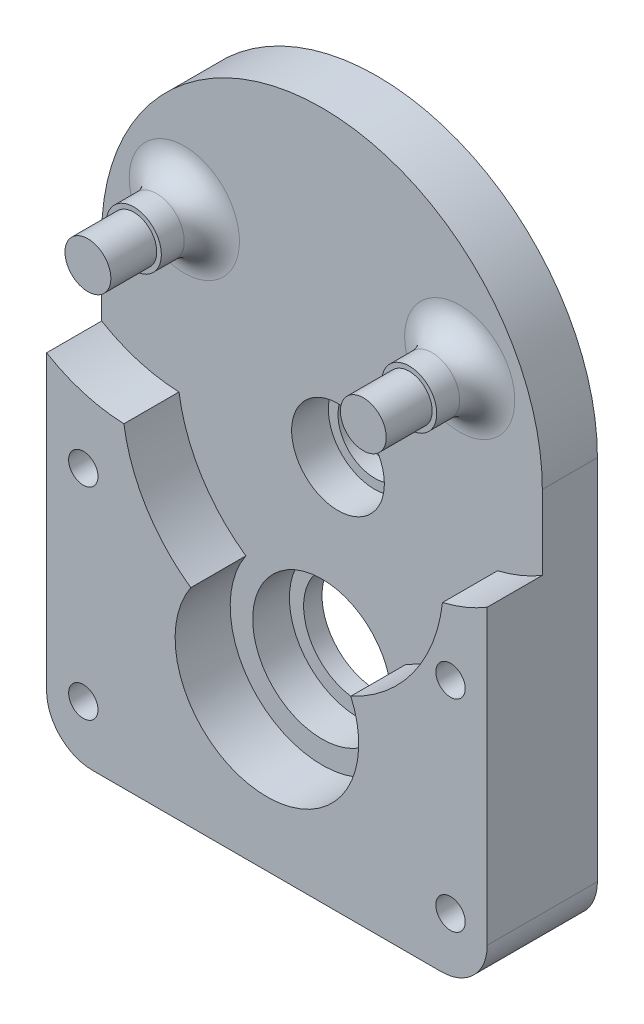
ISO-10303-21;
HEADER;
FILE_DESCRIPTION(('STEP AP214'),'2;1');
FILE_NAME('part.step','',(''),(''),'','','');
FILE_SCHEMA(('AUTOMOTIVE_DESIGN { 1 0 10303 214 1 1 1 1 }'));
ENDSEC;
DATA;
#1=APPLICATION_CONTEXT('core data for automotive mechanical design processes');
#2=APPLICATION_PROTOCOL_DEFINITION('international standard','automotive_design',2000,#1);
#3=PRODUCT_CONTEXT('',#1,'mechanical');
#4=PRODUCT('Part','Part','',(#3));
#5=PRODUCT_RELATED_PRODUCT_CATEGORY('part','',(#4));
#6=PRODUCT_DEFINITION_FORMATION('','',#4);
#7=PRODUCT_DEFINITION_CONTEXT('part definition',#1,'design');
#8=PRODUCT_DEFINITION('design','',#6,#7);
#9=PRODUCT_DEFINITION_SHAPE('','',#8);
#10=(LENGTH_UNIT() NAMED_UNIT(*) SI_UNIT(.MILLI.,.METRE.));
#11=(NAMED_UNIT(*) PLANE_ANGLE_UNIT() SI_UNIT($,.RADIAN.));
#12=(NAMED_UNIT(*) SI_UNIT($,.STERADIAN.) SOLID_ANGLE_UNIT());
#13=UNCERTAINTY_MEASURE_WITH_UNIT(LENGTH_MEASURE(1.E-05),#10,'distance_accuracy_value','');
#14=(GEOMETRIC_REPRESENTATION_CONTEXT(3) GLOBAL_UNCERTAINTY_ASSIGNED_CONTEXT((#13)) GLOBAL_UNIT_ASSIGNED_CONTEXT((#10,
#11,#12)) REPRESENTATION_CONTEXT('',''));
#15=CARTESIAN_POINT('',(0.,0.,0.));
#16=DIRECTION('',(0.,0.,1.));
#17=DIRECTION('',(1.,0.,0.));
#18=AXIS2_PLACEMENT_3D('',#15,#16,#17);
#19=CARTESIAN_POINT('',(20.,-39.,16.5));
#20=DIRECTION('',(0.,0.,-1.));
#21=DIRECTION('',(-1.,0.,0.));
#22=AXIS2_PLACEMENT_3D('',#19,#20,#21);
#23=CYLINDRICAL_SURFACE('',#22,1.6);
#24=CARTESIAN_POINT('',(20.,-39.,12.));
#25=DIRECTION('',(0.,0.,1.));
#26=DIRECTION('',(1.,0.,0.));
#27=AXIS2_PLACEMENT_3D('',#24,#25,#26);
#28=CIRCLE('',#27,1.6);
#29=CARTESIAN_POINT('',(21.6,-39.,12.));
#30=VERTEX_POINT('',#29);
#31=EDGE_CURVE('E239',#30,#30,#28,.T.);
#32=ORIENTED_EDGE('',*,*,#31,.T.);
#33=EDGE_LOOP('',(#32));
#34=FACE_BOUND('',#33,.T.);
#35=CARTESIAN_POINT('',(20.,-39.,6.));
#36=DIRECTION('',(0.,0.,-1.));
#37=DIRECTION('',(-1.,0.,0.));
#38=AXIS2_PLACEMENT_3D('',#35,#36,#37);
#39=CIRCLE('',#38,1.6);
#40=CARTESIAN_POINT('',(18.4,-39.,6.));
#41=VERTEX_POINT('',#40);
#42=EDGE_CURVE('E243',#41,#41,#39,.F.);
#43=ORIENTED_EDGE('',*,*,#42,.F.);
#44=EDGE_LOOP('',(#43));
#45=FACE_BOUND('',#44,.T.);
#46=ADVANCED_FACE('F41',(#34,#45),#23,.F.);
#47=CARTESIAN_POINT('',(-20.,-17.,16.5));
#48=DIRECTION('',(0.,0.,-1.));
#49=DIRECTION('',(-1.,0.,0.));
#50=AXIS2_PLACEMENT_3D('',#47,#48,#49);
#51=CYLINDRICAL_SURFACE('',#50,1.6);
#52=CARTESIAN_POINT('',(-20.,-17.,12.));
#53=DIRECTION('',(0.,0.,1.));
#54=DIRECTION('',(1.,0.,0.));
#55=AXIS2_PLACEMENT_3D('',#52,#53,#54);
#56=CIRCLE('',#55,1.6);
#57=CARTESIAN_POINT('',(-18.4,-17.,12.));
#58=VERTEX_POINT('',#57);
#59=EDGE_CURVE('E242',#58,#58,#56,.T.);
#60=ORIENTED_EDGE('',*,*,#59,.T.);
#61=EDGE_LOOP('',(#60));
#62=FACE_BOUND('',#61,.T.);
#63=CARTESIAN_POINT('',(-20.,-17.,6.));
#64=DIRECTION('',(0.,0.,-1.));
#65=DIRECTION('',(-1.,0.,0.));
#66=AXIS2_PLACEMENT_3D('',#63,#64,#65);
#67=CIRCLE('',#66,1.6);
#68=CARTESIAN_POINT('',(-21.6,-17.,6.));
#69=VERTEX_POINT('',#68);
#70=EDGE_CURVE('E259',#69,#69,#67,.F.);
#71=ORIENTED_EDGE('',*,*,#70,.F.);
#72=EDGE_LOOP('',(#71));
#73=FACE_BOUND('',#72,.T.);
#74=ADVANCED_FACE('F437',(#62,#73),#51,.F.);
#75=CARTESIAN_POINT('',(-20.,-39.,16.5));
#76=DIRECTION('',(0.,0.,-1.));
#77=DIRECTION('',(-1.,0.,0.));
#78=AXIS2_PLACEMENT_3D('',#75,#76,#77);
#79=CYLINDRICAL_SURFACE('',#78,1.6);
#80=CARTESIAN_POINT('',(-20.,-39.,12.));
#81=DIRECTION('',(0.,0.,1.));
#82=DIRECTION('',(1.,0.,0.));
#83=AXIS2_PLACEMENT_3D('',#80,#81,#82);
#84=CIRCLE('',#83,1.6);
#85=CARTESIAN_POINT('',(-18.4,-39.,12.));
#86=VERTEX_POINT('',#85);
#87=EDGE_CURVE('E246',#86,#86,#84,.T.);
#88=ORIENTED_EDGE('',*,*,#87,.T.);
#89=EDGE_LOOP('',(#88));
#90=FACE_BOUND('',#89,.T.);
#91=CARTESIAN_POINT('',(-20.,-39.,6.));
#92=DIRECTION('',(0.,0.,-1.));
#93=DIRECTION('',(-1.,0.,0.));
#94=AXIS2_PLACEMENT_3D('',#91,#92,#93);
#95=CIRCLE('',#94,1.6);
#96=CARTESIAN_POINT('',(-21.6,-39.,6.));
#97=VERTEX_POINT('',#96);
#98=EDGE_CURVE('E255',#97,#97,#95,.F.);
#99=ORIENTED_EDGE('',*,*,#98,.F.);
#100=EDGE_LOOP('',(#99));
#101=FACE_BOUND('',#100,.T.);
#102=ADVANCED_FACE('F443',(#90,#101),#79,.F.);
#103=CARTESIAN_POINT('',(20.,-17.,16.5));
#104=DIRECTION('',(0.,0.,-1.));
#105=DIRECTION('',(-1.,0.,0.));
#106=AXIS2_PLACEMENT_3D('',#103,#104,#105);
#107=CYLINDRICAL_SURFACE('',#106,1.6);
#108=CARTESIAN_POINT('',(20.,-17.,12.));
#109=DIRECTION('',(0.,0.,1.));
#110=DIRECTION('',(1.,0.,0.));
#111=AXIS2_PLACEMENT_3D('',#108,#109,#110);
#112=CIRCLE('',#111,1.6);
#113=CARTESIAN_POINT('',(21.6,-17.,12.));
#114=VERTEX_POINT('',#113);
#115=EDGE_CURVE('E249',#114,#114,#112,.T.);
#116=ORIENTED_EDGE('',*,*,#115,.T.);
#117=EDGE_LOOP('',(#116));
#118=FACE_BOUND('',#117,.T.);
#119=CARTESIAN_POINT('',(20.,-17.,6.));
#120=DIRECTION('',(0.,0.,-1.));
#121=DIRECTION('',(-1.,0.,0.));
#122=AXIS2_PLACEMENT_3D('',#119,#120,#121);
#123=CIRCLE('',#122,1.6);
#124=CARTESIAN_POINT('',(18.4,-17.,6.));
#125=VERTEX_POINT('',#124);
#126=EDGE_CURVE('E252',#125,#125,#123,.F.);
#127=ORIENTED_EDGE('',*,*,#126,.F.);
#128=EDGE_LOOP('',(#127));
#129=FACE_BOUND('',#128,.T.);
#130=ADVANCED_FACE('F400',(#118,#129),#107,.F.);
#131=CARTESIAN_POINT('',(0.,0.,6.));
#132=DIRECTION('',(0.,0.,-1.));
#133=DIRECTION('',(-1.,0.,0.));
#134=AXIS2_PLACEMENT_3D('',#131,#132,#133);
#135=PLANE('',#134);
#136=CARTESIAN_POINT('',(1.74311485495303,-8.07610603816508,6.));
#137=DIRECTION('',(0.,0.,1.));
#138=DIRECTION('',(1.,0.,0.));
#139=AXIS2_PLACEMENT_3D('',#136,#137,#138);
#140=CIRCLE('',#139,5.05);
#141=CARTESIAN_POINT('',(6.79311485495303,-8.07610603816508,6.));
#142=VERTEX_POINT('',#141);
#143=EDGE_CURVE('E178',#142,#142,#140,.T.);
#144=ORIENTED_EDGE('',*,*,#143,.F.);
#145=EDGE_LOOP('',(#144));
#146=FACE_BOUND('',#145,.T.);
#147=CARTESIAN_POINT('',(0.,-28.,6.));
#148=DIRECTION('',(0.,0.,1.));
#149=DIRECTION('',(1.,0.,0.));
#150=AXIS2_PLACEMENT_3D('',#147,#148,#149);
#151=CIRCLE('',#150,7.55);
#152=CARTESIAN_POINT('',(7.55,-28.,6.));
#153=VERTEX_POINT('',#152);
#154=EDGE_CURVE('E167',#153,#153,#151,.T.);
#155=ORIENTED_EDGE('',*,*,#154,.F.);
#156=EDGE_LOOP('',(#155));
#157=FACE_BOUND('',#156,.T.);
#158=CARTESIAN_POINT('',(-15.,6.89903991274414,6.));
#159=DIRECTION('',(0.,0.,-1.));
#160=DIRECTION('',(-1.,0.,0.));
#161=AXIS2_PLACEMENT_3D('',#158,#159,#160);
#162=CIRCLE('',#161,6.);
#163=CARTESIAN_POINT('',(-21.,6.89903991274414,6.));
#164=VERTEX_POINT('',#163);
#165=EDGE_CURVE('E229',#164,#164,#162,.T.);
#166=ORIENTED_EDGE('',*,*,#165,.T.);
#167=EDGE_LOOP('',(#166));
#168=FACE_BOUND('',#167,.T.);
#169=CARTESIAN_POINT('',(15.,6.89903991274414,6.));
#170=DIRECTION('',(0.,0.,-1.));
#171=DIRECTION('',(-1.,0.,0.));
#172=AXIS2_PLACEMENT_3D('',#169,#170,#171);
#173=CIRCLE('',#172,6.);
#174=CARTESIAN_POINT('',(9.,6.89903991274414,6.));
#175=VERTEX_POINT('',#174);
#176=EDGE_CURVE('E232',#175,#175,#173,.T.);
#177=ORIENTED_EDGE('',*,*,#176,.T.);
#178=EDGE_LOOP('',(#177));
#179=FACE_BOUND('',#178,.T.);
#180=CARTESIAN_POINT('',(-15.,6.89903991274414,6.));
#181=DIRECTION('',(0.,0.,-1.));
#182=DIRECTION('',(1.,0.,0.));
#183=AXIS2_PLACEMENT_3D('',#180,#181,#182);
#184=CIRCLE('',#183,17.5);
#185=CARTESIAN_POINT('',(-15.5751634768211,-10.5915057326876,6.));
#186=VERTEX_POINT('',#185);
#187=CARTESIAN_POINT('',(-24.,-8.10929110705949,6.));
#188=VERTEX_POINT('',#187);
#189=EDGE_CURVE('E322',#186,#188,#184,.T.);
#190=ORIENTED_EDGE('',*,*,#189,.F.);
#191=CARTESIAN_POINT('',(1.74311485495303,-8.07610603816508,6.));
#192=DIRECTION('',(0.,0.,-1.));
#193=DIRECTION('',(1.,0.,0.));
#194=AXIS2_PLACEMENT_3D('',#191,#192,#193);
#195=CIRCLE('',#194,17.5);
#196=CARTESIAN_POINT('',(-8.29315308800893,-22.4121907818137,6.));
#197=VERTEX_POINT('',#196);
#198=EDGE_CURVE('E327',#197,#186,#195,.T.);
#199=ORIENTED_EDGE('',*,*,#198,.F.);
#200=CARTESIAN_POINT('',(0.,-28.,6.));
#201=DIRECTION('',(0.,0.,-1.));
#202=DIRECTION('',(1.,0.,0.));
#203=AXIS2_PLACEMENT_3D('',#200,#201,#202);
#204=CIRCLE('',#203,10.);
#205=CARTESIAN_POINT('',(9.1374743458768,-23.9371730804225,6.));
#206=VERTEX_POINT('',#205);
#207=EDGE_CURVE('E328',#206,#197,#204,.T.);
#208=ORIENTED_EDGE('',*,*,#207,.F.);
#209=CARTESIAN_POINT('',(1.74311485495303,-8.07610603816508,6.));
#210=DIRECTION('',(0.,0.,-1.));
#211=DIRECTION('',(1.,0.,0.));
#212=AXIS2_PLACEMENT_3D('',#209,#210,#211);
#213=CIRCLE('',#212,17.5);
#214=CARTESIAN_POINT('',(19.1247654344826,-10.1079089644207,6.));
#215=VERTEX_POINT('',#214);
#216=EDGE_CURVE('E156',#215,#206,#213,.T.);
#217=ORIENTED_EDGE('',*,*,#216,.F.);
#218=CARTESIAN_POINT('',(15.,6.89903991274414,6.));
#219=DIRECTION('',(0.,0.,-1.));
#220=DIRECTION('',(1.,0.,0.));
#221=AXIS2_PLACEMENT_3D('',#218,#219,#220);
#222=CIRCLE('',#221,17.5);
#223=CARTESIAN_POINT('',(24.,-8.10929110705949,6.));
#224=VERTEX_POINT('',#223);
#225=EDGE_CURVE('E153',#224,#215,#222,.T.);
#226=ORIENTED_EDGE('',*,*,#225,.F.);
#227=DIRECTION('',(0.,1.,0.));
#228=VECTOR('',#227,1.);
#229=CARTESIAN_POINT('',(24.,-45.,6.));
#230=LINE('',#229,#228);
#231=CARTESIAN_POINT('',(24.,0.,6.));
#232=VERTEX_POINT('',#231);
#233=EDGE_CURVE('E213',#224,#232,#230,.T.);
#234=ORIENTED_EDGE('',*,*,#233,.T.);
#235=CARTESIAN_POINT('',(0.,0.,6.));
#236=DIRECTION('',(0.,0.,1.));
#237=DIRECTION('',(-1.,0.,0.));
#238=AXIS2_PLACEMENT_3D('',#235,#236,#237);
#239=CIRCLE('',#238,24.);
#240=CARTESIAN_POINT('',(-24.,0.,6.));
#241=VERTEX_POINT('',#240);
#242=EDGE_CURVE('E207',#232,#241,#239,.T.);
#243=ORIENTED_EDGE('',*,*,#242,.T.);
#244=DIRECTION('',(0.,-1.,0.));
#245=VECTOR('',#244,1.);
#246=CARTESIAN_POINT('',(-24.,0.,6.));
#247=LINE('',#246,#245);
#248=EDGE_CURVE('E210',#241,#188,#247,.T.);
#249=ORIENTED_EDGE('',*,*,#248,.T.);
#250=EDGE_LOOP('',(#190,#199,#208,#217,#226,#234,#243,#249));
#251=FACE_BOUND('',#250,.T.);
#252=ADVANCED_FACE('F397',(#146,#157,#168,#179,#251),#135,.F.);
#253=CARTESIAN_POINT('',(0.,0.,6.));
#254=DIRECTION('',(0.,0.,-1.));
#255=DIRECTION('',(-1.,0.,0.));
#256=AXIS2_PLACEMENT_3D('',#253,#254,#255);
#257=CYLINDRICAL_SURFACE('',#256,24.);
#258=CARTESIAN_POINT('',(0.,0.,0.));
#259=DIRECTION('',(0.,0.,1.));
#260=DIRECTION('',(-1.,0.,0.));
#261=AXIS2_PLACEMENT_3D('',#258,#259,#260);
#262=CIRCLE('',#261,24.);
#263=CARTESIAN_POINT('',(24.,0.,0.));
#264=VERTEX_POINT('',#263);
#265=CARTESIAN_POINT('',(-24.,0.,0.));
#266=VERTEX_POINT('',#265);
#267=EDGE_CURVE('E206',#264,#266,#262,.T.);
#268=ORIENTED_EDGE('',*,*,#267,.T.);
#269=DIRECTION('',(0.,0.,-1.));
#270=VECTOR('',#269,1.);
#271=CARTESIAN_POINT('',(-24.,0.,6.));
#272=LINE('',#271,#270);
#273=EDGE_CURVE('E200',#241,#266,#272,.T.);
#274=ORIENTED_EDGE('',*,*,#273,.F.);
#275=ORIENTED_EDGE('',*,*,#242,.F.);
#276=DIRECTION('',(0.,0.,-1.));
#277=VECTOR('',#276,1.);
#278=CARTESIAN_POINT('',(24.,0.,6.));
#279=LINE('',#278,#277);
#280=EDGE_CURVE('E215',#232,#264,#279,.T.);
#281=ORIENTED_EDGE('',*,*,#280,.T.);
#282=EDGE_LOOP('',(#268,#274,#275,#281));
#283=FACE_BOUND('',#282,.T.);
#284=ADVANCED_FACE('F303',(#283),#257,.T.);
#285=CARTESIAN_POINT('',(-24.,0.,6.));
#286=DIRECTION('',(1.,0.,0.));
#287=DIRECTION('',(0.,1.,0.));
#288=AXIS2_PLACEMENT_3D('',#285,#286,#287);
#289=PLANE('',#288);
#290=DIRECTION('',(0.,-1.,0.));
#291=VECTOR('',#290,1.);
#292=CARTESIAN_POINT('',(-24.,0.,0.));
#293=LINE('',#292,#291);
#294=CARTESIAN_POINT('',(-24.,-40.,0.));
#295=VERTEX_POINT('',#294);
#296=EDGE_CURVE('E218',#266,#295,#293,.T.);
#297=ORIENTED_EDGE('',*,*,#296,.T.);
#298=DIRECTION('',(0.,0.,-1.));
#299=VECTOR('',#298,1.);
#300=CARTESIAN_POINT('',(-24.,-40.,6.));
#301=LINE('',#300,#299);
#302=CARTESIAN_POINT('',(-24.,-40.,12.));
#303=VERTEX_POINT('',#302);
#304=EDGE_CURVE('E11',#295,#303,#301,.F.);
#305=ORIENTED_EDGE('',*,*,#304,.T.);
#306=DIRECTION('',(0.,-1.,0.));
#307=VECTOR('',#306,1.);
#308=CARTESIAN_POINT('',(-24.,-8.10929110705949,12.));
#309=LINE('',#308,#307);
#310=CARTESIAN_POINT('',(-24.,-8.10929110705949,12.));
#311=VERTEX_POINT('',#310);
#312=EDGE_CURVE('E336',#311,#303,#309,.T.);
#313=ORIENTED_EDGE('',*,*,#312,.F.);
#314=DIRECTION('',(0.,0.,-1.));
#315=VECTOR('',#314,1.);
#316=CARTESIAN_POINT('',(-24.,-8.10929110705949,12.));
#317=LINE('',#316,#315);
#318=EDGE_CURVE('E309',#311,#188,#317,.T.);
#319=ORIENTED_EDGE('',*,*,#318,.T.);
#320=ORIENTED_EDGE('',*,*,#248,.F.);
#321=ORIENTED_EDGE('',*,*,#273,.T.);
#322=EDGE_LOOP('',(#297,#305,#313,#319,#320,#321));
#323=FACE_BOUND('',#322,.T.);
#324=ADVANCED_FACE('F298',(#323),#289,.F.);
#325=CARTESIAN_POINT('',(-24.,-45.,6.));
#326=DIRECTION('',(0.,1.,0.));
#327=DIRECTION('',(0.,0.,1.));
#328=AXIS2_PLACEMENT_3D('',#325,#326,#327);
#329=PLANE('',#328);
#330=DIRECTION('',(1.,0.,0.));
#331=VECTOR('',#330,1.);
#332=CARTESIAN_POINT('',(-24.,-45.,0.));
#333=LINE('',#332,#331);
#334=CARTESIAN_POINT('',(-19.,-45.,0.));
#335=VERTEX_POINT('',#334);
#336=CARTESIAN_POINT('',(19.,-45.,0.));
#337=VERTEX_POINT('',#336);
#338=EDGE_CURVE('E220',#335,#337,#333,.T.);
#339=ORIENTED_EDGE('',*,*,#338,.T.);
#340=DIRECTION('',(0.,0.,-1.));
#341=VECTOR('',#340,1.);
#342=CARTESIAN_POINT('',(19.,-45.,6.));
#343=LINE('',#342,#341);
#344=CARTESIAN_POINT('',(19.,-45.,12.));
#345=VERTEX_POINT('',#344);
#346=EDGE_CURVE('E62',#337,#345,#343,.F.);
#347=ORIENTED_EDGE('',*,*,#346,.T.);
#348=DIRECTION('',(1.,0.,0.));
#349=VECTOR('',#348,1.);
#350=CARTESIAN_POINT('',(-24.,-45.,12.));
#351=LINE('',#350,#349);
#352=CARTESIAN_POINT('',(-19.,-45.,12.));
#353=VERTEX_POINT('',#352);
#354=EDGE_CURVE('E279',#353,#345,#351,.T.);
#355=ORIENTED_EDGE('',*,*,#354,.F.);
#356=DIRECTION('',(0.,0.,-1.));
#357=VECTOR('',#356,1.);
#358=CARTESIAN_POINT('',(-19.,-45.,6.));
#359=LINE('',#358,#357);
#360=EDGE_CURVE('E270',#353,#335,#359,.T.);
#361=ORIENTED_EDGE('',*,*,#360,.T.);
#362=EDGE_LOOP('',(#339,#347,#355,#361));
#363=FACE_BOUND('',#362,.T.);
#364=ADVANCED_FACE('F294',(#363),#329,.F.);
#365=CARTESIAN_POINT('',(24.,-45.,6.));
#366=DIRECTION('',(-1.,0.,0.));
#367=DIRECTION('',(0.,0.,1.));
#368=AXIS2_PLACEMENT_3D('',#365,#366,#367);
#369=PLANE('',#368);
#370=DIRECTION('',(0.,1.,0.));
#371=VECTOR('',#370,1.);
#372=CARTESIAN_POINT('',(24.,-45.,12.));
#373=LINE('',#372,#371);
#374=CARTESIAN_POINT('',(24.,-40.,12.));
#375=VERTEX_POINT('',#374);
#376=CARTESIAN_POINT('',(24.,-8.10929110705949,12.));
#377=VERTEX_POINT('',#376);
#378=EDGE_CURVE('E277',#375,#377,#373,.T.);
#379=ORIENTED_EDGE('',*,*,#378,.F.);
#380=DIRECTION('',(0.,0.,-1.));
#381=VECTOR('',#380,1.);
#382=CARTESIAN_POINT('',(24.,-40.,6.));
#383=LINE('',#382,#381);
#384=CARTESIAN_POINT('',(24.,-40.,0.));
#385=VERTEX_POINT('',#384);
#386=EDGE_CURVE('E238',#375,#385,#383,.T.);
#387=ORIENTED_EDGE('',*,*,#386,.T.);
#388=DIRECTION('',(0.,1.,0.));
#389=VECTOR('',#388,1.);
#390=CARTESIAN_POINT('',(24.,-45.,0.));
#391=LINE('',#390,#389);
#392=EDGE_CURVE('E211',#385,#264,#391,.T.);
#393=ORIENTED_EDGE('',*,*,#392,.T.);
#394=ORIENTED_EDGE('',*,*,#280,.F.);
#395=ORIENTED_EDGE('',*,*,#233,.F.);
#396=DIRECTION('',(0.,0.,-1.));
#397=VECTOR('',#396,1.);
#398=CARTESIAN_POINT('',(24.,-8.10929110705949,12.));
#399=LINE('',#398,#397);
#400=EDGE_CURVE('E287',#377,#224,#399,.T.);
#401=ORIENTED_EDGE('',*,*,#400,.F.);
#402=EDGE_LOOP('',(#379,#387,#393,#394,#395,#401));
#403=FACE_BOUND('',#402,.T.);
#404=ADVANCED_FACE('F283',(#403),#369,.F.);
#405=CARTESIAN_POINT('',(0.,0.,0.));
#406=DIRECTION('',(0.,0.,-1.));
#407=DIRECTION('',(-1.,0.,0.));
#408=AXIS2_PLACEMENT_3D('',#405,#406,#407);
#409=PLANE('',#408);
#410=CARTESIAN_POINT('',(20.,-39.,0.));
#411=DIRECTION('',(0.,0.,-1.));
#412=DIRECTION('',(-1.,0.,0.));
#413=AXIS2_PLACEMENT_3D('',#410,#411,#412);
#414=CIRCLE('',#413,2.1);
#415=CARTESIAN_POINT('',(17.9,-39.,0.));
#416=VERTEX_POINT('',#415);
#417=EDGE_CURVE('E343',#416,#416,#414,.T.);
#418=ORIENTED_EDGE('',*,*,#417,.F.);
#419=EDGE_LOOP('',(#418));
#420=FACE_BOUND('',#419,.T.);
#421=CARTESIAN_POINT('',(-20.,-17.,0.));
#422=DIRECTION('',(0.,0.,-1.));
#423=DIRECTION('',(-1.,0.,0.));
#424=AXIS2_PLACEMENT_3D('',#421,#422,#423);
#425=CIRCLE('',#424,2.1);
#426=CARTESIAN_POINT('',(-22.1,-17.,0.));
#427=VERTEX_POINT('',#426);
#428=EDGE_CURVE('E349',#427,#427,#425,.T.);
#429=ORIENTED_EDGE('',*,*,#428,.F.);
#430=EDGE_LOOP('',(#429));
#431=FACE_BOUND('',#430,.T.);
#432=CARTESIAN_POINT('',(-20.,-39.,0.));
#433=DIRECTION('',(0.,0.,-1.));
#434=DIRECTION('',(-1.,0.,0.));
#435=AXIS2_PLACEMENT_3D('',#432,#433,#434);
#436=CIRCLE('',#435,2.1);
#437=CARTESIAN_POINT('',(-22.1,-39.,0.));
#438=VERTEX_POINT('',#437);
#439=EDGE_CURVE('E350',#438,#438,#436,.T.);
#440=ORIENTED_EDGE('',*,*,#439,.F.);
#441=EDGE_LOOP('',(#440));
#442=FACE_BOUND('',#441,.T.);
#443=CARTESIAN_POINT('',(20.,-17.,0.));
#444=DIRECTION('',(0.,0.,-1.));
#445=DIRECTION('',(-1.,0.,0.));
#446=AXIS2_PLACEMENT_3D('',#443,#444,#445);
#447=CIRCLE('',#446,2.1);
#448=CARTESIAN_POINT('',(17.9,-17.,0.));
#449=VERTEX_POINT('',#448);
#450=EDGE_CURVE('E340',#449,#449,#447,.T.);
#451=ORIENTED_EDGE('',*,*,#450,.F.);
#452=EDGE_LOOP('',(#451));
#453=FACE_BOUND('',#452,.T.);
#454=CARTESIAN_POINT('',(0.,-28.,0.));
#455=DIRECTION('',(0.,0.,1.));
#456=DIRECTION('',(1.,0.,0.));
#457=AXIS2_PLACEMENT_3D('',#454,#455,#456);
#458=CIRCLE('',#457,6.);
#459=CARTESIAN_POINT('',(6.,-28.,0.));
#460=VERTEX_POINT('',#459);
#461=EDGE_CURVE('E160',#460,#460,#458,.T.);
#462=ORIENTED_EDGE('',*,*,#461,.T.);
#463=EDGE_LOOP('',(#462));
#464=FACE_BOUND('',#463,.T.);
#465=CARTESIAN_POINT('',(1.74311485495303,-8.07610603816508,0.));
#466=DIRECTION('',(0.,0.,1.));
#467=DIRECTION('',(1.,0.,0.));
#468=AXIS2_PLACEMENT_3D('',#465,#466,#467);
#469=CIRCLE('',#468,4.);
#470=CARTESIAN_POINT('',(5.74311485495303,-8.07610603816508,0.));
#471=VERTEX_POINT('',#470);
#472=EDGE_CURVE('E175',#471,#471,#469,.T.);
#473=ORIENTED_EDGE('',*,*,#472,.T.);
#474=EDGE_LOOP('',(#473));
#475=FACE_BOUND('',#474,.T.);
#476=ORIENTED_EDGE('',*,*,#392,.F.);
#477=CARTESIAN_POINT('',(19.,-40.,0.));
#478=DIRECTION('',(0.,0.,-1.));
#479=DIRECTION('',(-1.,0.,0.));
#480=AXIS2_PLACEMENT_3D('',#477,#478,#479);
#481=CIRCLE('',#480,5.);
#482=EDGE_CURVE('E268',#385,#337,#481,.T.);
#483=ORIENTED_EDGE('',*,*,#482,.T.);
#484=ORIENTED_EDGE('',*,*,#338,.F.);
#485=CARTESIAN_POINT('',(-19.,-40.,0.));
#486=DIRECTION('',(0.,0.,-1.));
#487=DIRECTION('',(-1.,0.,0.));
#488=AXIS2_PLACEMENT_3D('',#485,#486,#487);
#489=CIRCLE('',#488,5.);
#490=EDGE_CURVE('E266',#335,#295,#489,.T.);
#491=ORIENTED_EDGE('',*,*,#490,.T.);
#492=ORIENTED_EDGE('',*,*,#296,.F.);
#493=ORIENTED_EDGE('',*,*,#267,.F.);
#494=EDGE_LOOP('',(#476,#483,#484,#491,#492,#493));
#495=FACE_BOUND('',#494,.T.);
#496=ADVANCED_FACE('F292',(#420,#431,#442,#453,#464,#475,#495),#409,.T.);
#497=CARTESIAN_POINT('',(-15.,6.89903991274414,11.5));
#498=DIRECTION('',(0.,0.,-1.));
#499=DIRECTION('',(-1.,0.,0.));
#500=AXIS2_PLACEMENT_3D('',#497,#498,#499);
#501=CYLINDRICAL_SURFACE('',#500,3.);
#502=CARTESIAN_POINT('',(-15.,6.89903991274414,9.));
#503=DIRECTION('',(0.,0.,-1.));
#504=DIRECTION('',(-1.,0.,0.));
#505=AXIS2_PLACEMENT_3D('',#502,#503,#504);
#506=CIRCLE('',#505,3.);
#507=CARTESIAN_POINT('',(-18.,6.89903991274414,9.));
#508=VERTEX_POINT('',#507);
#509=EDGE_CURVE('E235',#508,#508,#506,.F.);
#510=ORIENTED_EDGE('',*,*,#509,.T.);
#511=EDGE_LOOP('',(#510));
#512=FACE_BOUND('',#511,.T.);
#513=CARTESIAN_POINT('',(-15.,6.89903991274414,11.5));
#514=DIRECTION('',(0.,0.,1.));
#515=DIRECTION('',(1.,0.,0.));
#516=AXIS2_PLACEMENT_3D('',#513,#514,#515);
#517=CIRCLE('',#516,3.);
#518=CARTESIAN_POINT('',(-12.,6.89903991274414,11.5));
#519=VERTEX_POINT('',#518);
#520=EDGE_CURVE('E203',#519,#519,#517,.T.);
#521=ORIENTED_EDGE('',*,*,#520,.F.);
#522=EDGE_LOOP('',(#521));
#523=FACE_BOUND('',#522,.T.);
#524=ADVANCED_FACE('F368',(#512,#523),#501,.T.);
#525=CARTESIAN_POINT('',(-15.,6.89903991274414,11.5));
#526=DIRECTION('',(0.,0.,1.));
#527=DIRECTION('',(1.,0.,0.));
#528=AXIS2_PLACEMENT_3D('',#525,#526,#527);
#529=PLANE('',#528);
#530=CARTESIAN_POINT('',(-15.,6.89903991274414,11.5));
#531=DIRECTION('',(0.,0.,1.));
#532=DIRECTION('',(1.,0.,0.));
#533=AXIS2_PLACEMENT_3D('',#530,#531,#532);
#534=CIRCLE('',#533,2.5);
#535=CARTESIAN_POINT('',(-12.5,6.89903991274414,11.5));
#536=VERTEX_POINT('',#535);
#537=EDGE_CURVE('E191',#536,#536,#534,.T.);
#538=ORIENTED_EDGE('',*,*,#537,.F.);
#539=EDGE_LOOP('',(#538));
#540=FACE_BOUND('',#539,.T.);
#541=ORIENTED_EDGE('',*,*,#520,.T.);
#542=EDGE_LOOP('',(#541));
#543=FACE_BOUND('',#542,.T.);
#544=ADVANCED_FACE('F420',(#540,#543),#529,.T.);
#545=CARTESIAN_POINT('',(15.,6.89903991274414,11.5));
#546=DIRECTION('',(0.,0.,-1.));
#547=DIRECTION('',(-1.,0.,0.));
#548=AXIS2_PLACEMENT_3D('',#545,#546,#547);
#549=CYLINDRICAL_SURFACE('',#548,3.);
#550=CARTESIAN_POINT('',(15.,6.89903991274414,9.));
#551=DIRECTION('',(0.,0.,-1.));
#552=DIRECTION('',(-1.,0.,0.));
#553=AXIS2_PLACEMENT_3D('',#550,#551,#552);
#554=CIRCLE('',#553,3.);
#555=CARTESIAN_POINT('',(12.,6.89903991274414,9.));
#556=VERTEX_POINT('',#555);
#557=EDGE_CURVE('E190',#556,#556,#554,.F.);
#558=ORIENTED_EDGE('',*,*,#557,.T.);
#559=EDGE_LOOP('',(#558));
#560=FACE_BOUND('',#559,.T.);
#561=CARTESIAN_POINT('',(15.,6.89903991274414,11.5));
#562=DIRECTION('',(0.,0.,1.));
#563=DIRECTION('',(1.,0.,0.));
#564=AXIS2_PLACEMENT_3D('',#561,#562,#563);
#565=CIRCLE('',#564,3.);
#566=CARTESIAN_POINT('',(18.,6.89903991274414,11.5));
#567=VERTEX_POINT('',#566);
#568=EDGE_CURVE('E197',#567,#567,#565,.T.);
#569=ORIENTED_EDGE('',*,*,#568,.F.);
#570=EDGE_LOOP('',(#569));
#571=FACE_BOUND('',#570,.T.);
#572=ADVANCED_FACE('F416',(#560,#571),#549,.T.);
#573=CARTESIAN_POINT('',(15.,6.89903991274414,11.5));
#574=DIRECTION('',(0.,0.,1.));
#575=DIRECTION('',(1.,0.,0.));
#576=AXIS2_PLACEMENT_3D('',#573,#574,#575);
#577=PLANE('',#576);
#578=CARTESIAN_POINT('',(15.,6.89903991274414,11.5));
#579=DIRECTION('',(0.,0.,1.));
#580=DIRECTION('',(1.,0.,0.));
#581=AXIS2_PLACEMENT_3D('',#578,#579,#580);
#582=CIRCLE('',#581,2.5);
#583=CARTESIAN_POINT('',(17.5,6.89903991274414,11.5));
#584=VERTEX_POINT('',#583);
#585=EDGE_CURVE('E187',#584,#584,#582,.T.);
#586=ORIENTED_EDGE('',*,*,#585,.F.);
#587=EDGE_LOOP('',(#586));
#588=FACE_BOUND('',#587,.T.);
#589=ORIENTED_EDGE('',*,*,#568,.T.);
#590=EDGE_LOOP('',(#589));
#591=FACE_BOUND('',#590,.T.);
#592=ADVANCED_FACE('F419',(#588,#591),#577,.T.);
#593=CARTESIAN_POINT('',(-15.,6.89903991274414,16.5));
#594=DIRECTION('',(0.,0.,-1.));
#595=DIRECTION('',(-1.,0.,0.));
#596=AXIS2_PLACEMENT_3D('',#593,#594,#595);
#597=CYLINDRICAL_SURFACE('',#596,2.5);
#598=CARTESIAN_POINT('',(-15.,6.89903991274414,16.5));
#599=DIRECTION('',(0.,0.,1.));
#600=DIRECTION('',(1.,0.,0.));
#601=AXIS2_PLACEMENT_3D('',#598,#599,#600);
#602=CIRCLE('',#601,2.5);
#603=CARTESIAN_POINT('',(-12.5,6.89903991274414,16.5));
#604=VERTEX_POINT('',#603);
#605=EDGE_CURVE('E194',#604,#604,#602,.T.);
#606=ORIENTED_EDGE('',*,*,#605,.F.);
#607=EDGE_LOOP('',(#606));
#608=FACE_BOUND('',#607,.T.);
#609=ORIENTED_EDGE('',*,*,#537,.T.);
#610=EDGE_LOOP('',(#609));
#611=FACE_BOUND('',#610,.T.);
#612=ADVANCED_FACE('F425',(#608,#611),#597,.T.);
#613=CARTESIAN_POINT('',(-15.,6.89903991274414,16.5));
#614=DIRECTION('',(0.,0.,1.));
#615=DIRECTION('',(1.,0.,0.));
#616=AXIS2_PLACEMENT_3D('',#613,#614,#615);
#617=PLANE('',#616);
#618=ORIENTED_EDGE('',*,*,#605,.T.);
#619=EDGE_LOOP('',(#618));
#620=FACE_BOUND('',#619,.T.);
#621=ADVANCED_FACE('F431',(#620),#617,.T.);
#622=CARTESIAN_POINT('',(15.,6.89903991274414,16.5));
#623=DIRECTION('',(0.,0.,-1.));
#624=DIRECTION('',(-1.,0.,0.));
#625=AXIS2_PLACEMENT_3D('',#622,#623,#624);
#626=CYLINDRICAL_SURFACE('',#625,2.5);
#627=CARTESIAN_POINT('',(15.,6.89903991274414,16.5));
#628=DIRECTION('',(0.,0.,1.));
#629=DIRECTION('',(1.,0.,0.));
#630=AXIS2_PLACEMENT_3D('',#627,#628,#629);
#631=CIRCLE('',#630,2.5);
#632=CARTESIAN_POINT('',(17.5,6.89903991274414,16.5));
#633=VERTEX_POINT('',#632);
#634=EDGE_CURVE('E184',#633,#633,#631,.T.);
#635=ORIENTED_EDGE('',*,*,#634,.F.);
#636=EDGE_LOOP('',(#635));
#637=FACE_BOUND('',#636,.T.);
#638=ORIENTED_EDGE('',*,*,#585,.T.);
#639=EDGE_LOOP('',(#638));
#640=FACE_BOUND('',#639,.T.);
#641=ADVANCED_FACE('F474',(#637,#640),#626,.T.);
#642=CARTESIAN_POINT('',(15.,6.89903991274414,16.5));
#643=DIRECTION('',(0.,0.,1.));
#644=DIRECTION('',(1.,0.,0.));
#645=AXIS2_PLACEMENT_3D('',#642,#643,#644);
#646=PLANE('',#645);
#647=ORIENTED_EDGE('',*,*,#634,.T.);
#648=EDGE_LOOP('',(#647));
#649=FACE_BOUND('',#648,.T.);
#650=ADVANCED_FACE('F393',(#649),#646,.T.);
#651=CARTESIAN_POINT('',(1.74311485495303,-8.07610603816508,2.));
#652=DIRECTION('',(0.,0.,1.));
#653=DIRECTION('',(1.,0.,0.));
#654=AXIS2_PLACEMENT_3D('',#651,#652,#653);
#655=CYLINDRICAL_SURFACE('',#654,5.05);
#656=CARTESIAN_POINT('',(1.74311485495303,-8.07610603816508,2.));
#657=DIRECTION('',(0.,0.,1.));
#658=DIRECTION('',(1.,0.,0.));
#659=AXIS2_PLACEMENT_3D('',#656,#657,#658);
#660=CIRCLE('',#659,5.05);
#661=CARTESIAN_POINT('',(6.79311485495303,-8.07610603816508,2.));
#662=VERTEX_POINT('',#661);
#663=EDGE_CURVE('E181',#662,#662,#660,.T.);
#664=ORIENTED_EDGE('',*,*,#663,.F.);
#665=EDGE_LOOP('',(#664));
#666=FACE_BOUND('',#665,.T.);
#667=ORIENTED_EDGE('',*,*,#143,.T.);
#668=EDGE_LOOP('',(#667));
#669=FACE_BOUND('',#668,.T.);
#670=ADVANCED_FACE('F387',(#666,#669),#655,.F.);
#671=CARTESIAN_POINT('',(1.74311485495303,-8.07610603816508,2.));
#672=DIRECTION('',(0.,0.,1.));
#673=DIRECTION('',(1.,0.,0.));
#674=AXIS2_PLACEMENT_3D('',#671,#672,#673);
#675=PLANE('',#674);
#676=CARTESIAN_POINT('',(1.74311485495303,-8.07610603816508,2.));
#677=DIRECTION('',(0.,0.,1.));
#678=DIRECTION('',(1.,0.,0.));
#679=AXIS2_PLACEMENT_3D('',#676,#677,#678);
#680=CIRCLE('',#679,4.);
#681=CARTESIAN_POINT('',(5.74311485495303,-8.07610603816508,2.));
#682=VERTEX_POINT('',#681);
#683=EDGE_CURVE('E172',#682,#682,#680,.T.);
#684=ORIENTED_EDGE('',*,*,#683,.F.);
#685=EDGE_LOOP('',(#684));
#686=FACE_BOUND('',#685,.T.);
#687=ORIENTED_EDGE('',*,*,#663,.T.);
#688=EDGE_LOOP('',(#687));
#689=FACE_BOUND('',#688,.T.);
#690=ADVANCED_FACE('F381',(#686,#689),#675,.T.);
#691=CARTESIAN_POINT('',(1.74311485495303,-8.07610603816508,0.));
#692=DIRECTION('',(0.,0.,1.));
#693=DIRECTION('',(1.,0.,0.));
#694=AXIS2_PLACEMENT_3D('',#691,#692,#693);
#695=CYLINDRICAL_SURFACE('',#694,4.);
#696=ORIENTED_EDGE('',*,*,#472,.F.);
#697=EDGE_LOOP('',(#696));
#698=FACE_BOUND('',#697,.T.);
#699=ORIENTED_EDGE('',*,*,#683,.T.);
#700=EDGE_LOOP('',(#699));
#701=FACE_BOUND('',#700,.T.);
#702=ADVANCED_FACE('F377',(#698,#701),#695,.F.);
#703=CARTESIAN_POINT('',(0.,-28.,2.));
#704=DIRECTION('',(0.,0.,1.));
#705=DIRECTION('',(1.,0.,0.));
#706=AXIS2_PLACEMENT_3D('',#703,#704,#705);
#707=CYLINDRICAL_SURFACE('',#706,7.55);
#708=CARTESIAN_POINT('',(0.,-28.,2.));
#709=DIRECTION('',(0.,0.,1.));
#710=DIRECTION('',(1.,0.,0.));
#711=AXIS2_PLACEMENT_3D('',#708,#709,#710);
#712=CIRCLE('',#711,7.55);
#713=CARTESIAN_POINT('',(7.55,-28.,2.));
#714=VERTEX_POINT('',#713);
#715=EDGE_CURVE('E169',#714,#714,#712,.T.);
#716=ORIENTED_EDGE('',*,*,#715,.F.);
#717=EDGE_LOOP('',(#716));
#718=FACE_BOUND('',#717,.T.);
#719=ORIENTED_EDGE('',*,*,#154,.T.);
#720=EDGE_LOOP('',(#719));
#721=FACE_BOUND('',#720,.T.);
#722=ADVANCED_FACE('F380',(#718,#721),#707,.F.);
#723=CARTESIAN_POINT('',(0.,-28.,2.));
#724=DIRECTION('',(0.,0.,1.));
#725=DIRECTION('',(1.,0.,0.));
#726=AXIS2_PLACEMENT_3D('',#723,#724,#725);
#727=PLANE('',#726);
#728=CARTESIAN_POINT('',(0.,-28.,2.));
#729=DIRECTION('',(0.,0.,1.));
#730=DIRECTION('',(1.,0.,0.));
#731=AXIS2_PLACEMENT_3D('',#728,#729,#730);
#732=CIRCLE('',#731,6.);
#733=CARTESIAN_POINT('',(6.,-28.,2.));
#734=VERTEX_POINT('',#733);
#735=EDGE_CURVE('E157',#734,#734,#732,.T.);
#736=ORIENTED_EDGE('',*,*,#735,.F.);
#737=EDGE_LOOP('',(#736));
#738=FACE_BOUND('',#737,.T.);
#739=ORIENTED_EDGE('',*,*,#715,.T.);
#740=EDGE_LOOP('',(#739));
#741=FACE_BOUND('',#740,.T.);
#742=ADVANCED_FACE('F466',(#738,#741),#727,.T.);
#743=CARTESIAN_POINT('',(0.,-28.,0.));
#744=DIRECTION('',(0.,0.,1.));
#745=DIRECTION('',(1.,0.,0.));
#746=AXIS2_PLACEMENT_3D('',#743,#744,#745);
#747=CYLINDRICAL_SURFACE('',#746,6.);
#748=ORIENTED_EDGE('',*,*,#461,.F.);
#749=EDGE_LOOP('',(#748));
#750=FACE_BOUND('',#749,.T.);
#751=ORIENTED_EDGE('',*,*,#735,.T.);
#752=EDGE_LOOP('',(#751));
#753=FACE_BOUND('',#752,.T.);
#754=ADVANCED_FACE('F412',(#750,#753),#747,.F.);
#755=CARTESIAN_POINT('',(15.,6.89903991274414,9.));
#756=DIRECTION('',(0.,0.,-1.));
#757=DIRECTION('',(-1.,0.,0.));
#758=AXIS2_PLACEMENT_3D('',#755,#756,#757);
#759=TOROIDAL_SURFACE('',#758,6.,3.);
#760=ORIENTED_EDGE('',*,*,#176,.F.);
#761=EDGE_LOOP('',(#760));
#762=FACE_BOUND('',#761,.T.);
#763=ORIENTED_EDGE('',*,*,#557,.F.);
#764=EDGE_LOOP('',(#763));
#765=FACE_BOUND('',#764,.T.);
#766=ADVANCED_FACE('F408',(#762,#765),#759,.F.);
#767=CARTESIAN_POINT('',(-15.,6.89903991274414,9.));
#768=DIRECTION('',(0.,0.,-1.));
#769=DIRECTION('',(-1.,0.,0.));
#770=AXIS2_PLACEMENT_3D('',#767,#768,#769);
#771=TOROIDAL_SURFACE('',#770,6.,3.);
#772=ORIENTED_EDGE('',*,*,#165,.F.);
#773=EDGE_LOOP('',(#772));
#774=FACE_BOUND('',#773,.T.);
#775=ORIENTED_EDGE('',*,*,#509,.F.);
#776=EDGE_LOOP('',(#775));
#777=FACE_BOUND('',#776,.T.);
#778=ADVANCED_FACE('F411',(#774,#777),#771,.F.);
#779=CARTESIAN_POINT('',(1.74311485495303,-8.07610603816508,12.));
#780=DIRECTION('',(0.,0.,-1.));
#781=DIRECTION('',(-1.,0.,0.));
#782=AXIS2_PLACEMENT_3D('',#779,#780,#781);
#783=CYLINDRICAL_SURFACE('',#782,17.5);
#784=ORIENTED_EDGE('',*,*,#216,.T.);
#785=DIRECTION('',(0.,0.,-1.));
#786=VECTOR('',#785,1.);
#787=CARTESIAN_POINT('',(9.1374743458768,-23.9371730804225,12.));
#788=LINE('',#787,#786);
#789=CARTESIAN_POINT('',(9.1374743458768,-23.9371730804225,12.));
#790=VERTEX_POINT('',#789);
#791=EDGE_CURVE('E137',#790,#206,#788,.T.);
#792=ORIENTED_EDGE('',*,*,#791,.F.);
#793=CARTESIAN_POINT('',(1.74311485495303,-8.07610603816508,12.));
#794=DIRECTION('',(0.,0.,-1.));
#795=DIRECTION('',(1.,0.,0.));
#796=AXIS2_PLACEMENT_3D('',#793,#794,#795);
#797=CIRCLE('',#796,17.5);
#798=CARTESIAN_POINT('',(19.1247654344826,-10.1079089644207,12.));
#799=VERTEX_POINT('',#798);
#800=EDGE_CURVE('E144',#799,#790,#797,.T.);
#801=ORIENTED_EDGE('',*,*,#800,.F.);
#802=DIRECTION('',(0.,0.,-1.));
#803=VECTOR('',#802,1.);
#804=CARTESIAN_POINT('',(19.1247654344826,-10.1079089644207,12.));
#805=LINE('',#804,#803);
#806=EDGE_CURVE('E310',#799,#215,#805,.T.);
#807=ORIENTED_EDGE('',*,*,#806,.T.);
#808=EDGE_LOOP('',(#784,#792,#801,#807));
#809=FACE_BOUND('',#808,.T.);
#810=ADVANCED_FACE('F155',(#809),#783,.F.);
#811=CARTESIAN_POINT('',(0.,-28.,12.));
#812=DIRECTION('',(0.,0.,-1.));
#813=DIRECTION('',(-1.,0.,0.));
#814=AXIS2_PLACEMENT_3D('',#811,#812,#813);
#815=CYLINDRICAL_SURFACE('',#814,10.);
#816=ORIENTED_EDGE('',*,*,#207,.T.);
#817=DIRECTION('',(0.,0.,-1.));
#818=VECTOR('',#817,1.);
#819=CARTESIAN_POINT('',(-8.29315308800893,-22.4121907818137,12.));
#820=LINE('',#819,#818);
#821=CARTESIAN_POINT('',(-8.29315308800893,-22.4121907818137,12.));
#822=VERTEX_POINT('',#821);
#823=EDGE_CURVE('E140',#822,#197,#820,.T.);
#824=ORIENTED_EDGE('',*,*,#823,.F.);
#825=CARTESIAN_POINT('',(0.,-28.,12.));
#826=DIRECTION('',(0.,0.,-1.));
#827=DIRECTION('',(1.,0.,0.));
#828=AXIS2_PLACEMENT_3D('',#825,#826,#827);
#829=CIRCLE('',#828,10.);
#830=EDGE_CURVE('E132',#790,#822,#829,.T.);
#831=ORIENTED_EDGE('',*,*,#830,.F.);
#832=ORIENTED_EDGE('',*,*,#791,.T.);
#833=EDGE_LOOP('',(#816,#824,#831,#832));
#834=FACE_BOUND('',#833,.T.);
#835=ADVANCED_FACE('F135',(#834),#815,.F.);
#836=CARTESIAN_POINT('',(1.74311485495303,-8.07610603816508,12.));
#837=DIRECTION('',(0.,0.,-1.));
#838=DIRECTION('',(-1.,0.,0.));
#839=AXIS2_PLACEMENT_3D('',#836,#837,#838);
#840=CYLINDRICAL_SURFACE('',#839,17.5);
#841=ORIENTED_EDGE('',*,*,#198,.T.);
#842=DIRECTION('',(0.,0.,-1.));
#843=VECTOR('',#842,1.);
#844=CARTESIAN_POINT('',(-15.5751634768211,-10.5915057326876,12.));
#845=LINE('',#844,#843);
#846=CARTESIAN_POINT('',(-15.5751634768211,-10.5915057326876,12.));
#847=VERTEX_POINT('',#846);
#848=EDGE_CURVE('E162',#847,#186,#845,.T.);
#849=ORIENTED_EDGE('',*,*,#848,.F.);
#850=CARTESIAN_POINT('',(1.74311485495303,-8.07610603816508,12.));
#851=DIRECTION('',(0.,0.,-1.));
#852=DIRECTION('',(1.,0.,0.));
#853=AXIS2_PLACEMENT_3D('',#850,#851,#852);
#854=CIRCLE('',#853,17.5);
#855=EDGE_CURVE('E143',#822,#847,#854,.T.);
#856=ORIENTED_EDGE('',*,*,#855,.F.);
#857=ORIENTED_EDGE('',*,*,#823,.T.);
#858=EDGE_LOOP('',(#841,#849,#856,#857));
#859=FACE_BOUND('',#858,.T.);
#860=ADVANCED_FACE('F326',(#859),#840,.F.);
#861=CARTESIAN_POINT('',(-15.,6.89903991274414,12.));
#862=DIRECTION('',(0.,0.,-1.));
#863=DIRECTION('',(-1.,0.,0.));
#864=AXIS2_PLACEMENT_3D('',#861,#862,#863);
#865=CYLINDRICAL_SURFACE('',#864,17.5);
#866=ORIENTED_EDGE('',*,*,#189,.T.);
#867=ORIENTED_EDGE('',*,*,#318,.F.);
#868=CARTESIAN_POINT('',(-15.,6.89903991274414,12.));
#869=DIRECTION('',(0.,0.,-1.));
#870=DIRECTION('',(1.,0.,0.));
#871=AXIS2_PLACEMENT_3D('',#868,#869,#870);
#872=CIRCLE('',#871,17.5);
#873=EDGE_CURVE('E323',#847,#311,#872,.T.);
#874=ORIENTED_EDGE('',*,*,#873,.F.);
#875=ORIENTED_EDGE('',*,*,#848,.T.);
#876=EDGE_LOOP('',(#866,#867,#874,#875));
#877=FACE_BOUND('',#876,.T.);
#878=ADVANCED_FACE('F320',(#877),#865,.F.);
#879=CARTESIAN_POINT('',(15.,6.89903991274414,12.));
#880=DIRECTION('',(0.,0.,-1.));
#881=DIRECTION('',(-1.,0.,0.));
#882=AXIS2_PLACEMENT_3D('',#879,#880,#881);
#883=CYLINDRICAL_SURFACE('',#882,17.5);
#884=ORIENTED_EDGE('',*,*,#225,.T.);
#885=ORIENTED_EDGE('',*,*,#806,.F.);
#886=CARTESIAN_POINT('',(15.,6.89903991274414,12.));
#887=DIRECTION('',(0.,0.,-1.));
#888=DIRECTION('',(1.,0.,0.));
#889=AXIS2_PLACEMENT_3D('',#886,#887,#888);
#890=CIRCLE('',#889,17.5);
#891=EDGE_CURVE('E149',#377,#799,#890,.T.);
#892=ORIENTED_EDGE('',*,*,#891,.F.);
#893=ORIENTED_EDGE('',*,*,#400,.T.);
#894=EDGE_LOOP('',(#884,#885,#892,#893));
#895=FACE_BOUND('',#894,.T.);
#896=ADVANCED_FACE('F308',(#895),#883,.F.);
#897=CARTESIAN_POINT('',(1.74311485495303,-8.07610603816508,12.));
#898=DIRECTION('',(0.,0.,1.));
#899=DIRECTION('',(1.,0.,0.));
#900=AXIS2_PLACEMENT_3D('',#897,#898,#899);
#901=PLANE('',#900);
#902=ORIENTED_EDGE('',*,*,#115,.F.);
#903=EDGE_LOOP('',(#902));
#904=FACE_BOUND('',#903,.T.);
#905=ORIENTED_EDGE('',*,*,#87,.F.);
#906=EDGE_LOOP('',(#905));
#907=FACE_BOUND('',#906,.T.);
#908=ORIENTED_EDGE('',*,*,#59,.F.);
#909=EDGE_LOOP('',(#908));
#910=FACE_BOUND('',#909,.T.);
#911=ORIENTED_EDGE('',*,*,#31,.F.);
#912=EDGE_LOOP('',(#911));
#913=FACE_BOUND('',#912,.T.);
#914=ORIENTED_EDGE('',*,*,#354,.T.);
#915=CARTESIAN_POINT('',(19.,-40.,12.));
#916=DIRECTION('',(0.,0.,1.));
#917=DIRECTION('',(1.,0.,0.));
#918=AXIS2_PLACEMENT_3D('',#915,#916,#917);
#919=CIRCLE('',#918,5.);
#920=EDGE_CURVE('E49',#345,#375,#919,.T.);
#921=ORIENTED_EDGE('',*,*,#920,.T.);
#922=ORIENTED_EDGE('',*,*,#378,.T.);
#923=ORIENTED_EDGE('',*,*,#891,.T.);
#924=ORIENTED_EDGE('',*,*,#800,.T.);
#925=ORIENTED_EDGE('',*,*,#830,.T.);
#926=ORIENTED_EDGE('',*,*,#855,.T.);
#927=ORIENTED_EDGE('',*,*,#873,.T.);
#928=ORIENTED_EDGE('',*,*,#312,.T.);
#929=CARTESIAN_POINT('',(-19.,-40.,12.));
#930=DIRECTION('',(0.,0.,1.));
#931=DIRECTION('',(1.,0.,0.));
#932=AXIS2_PLACEMENT_3D('',#929,#930,#931);
#933=CIRCLE('',#932,5.);
#934=EDGE_CURVE('E274',#303,#353,#933,.T.);
#935=ORIENTED_EDGE('',*,*,#934,.T.);
#936=EDGE_LOOP('',(#914,#921,#922,#923,#924,#925,#926,#927,#928,#935));
#937=FACE_BOUND('',#936,.T.);
#938=ADVANCED_FACE('F147',(#904,#907,#910,#913,#937),#901,.T.);
#939=CARTESIAN_POINT('',(20.,-17.,6.));
#940=DIRECTION('',(0.,0.,-1.));
#941=DIRECTION('',(-1.,0.,0.));
#942=AXIS2_PLACEMENT_3D('',#939,#940,#941);
#943=PLANE('',#942);
#944=CARTESIAN_POINT('',(20.,-17.,6.));
#945=DIRECTION('',(0.,0.,-1.));
#946=DIRECTION('',(-1.,0.,0.));
#947=AXIS2_PLACEMENT_3D('',#944,#945,#946);
#948=CIRCLE('',#947,2.1);
#949=CARTESIAN_POINT('',(17.9,-17.,6.));
#950=VERTEX_POINT('',#949);
#951=EDGE_CURVE('E256',#950,#950,#948,.T.);
#952=ORIENTED_EDGE('',*,*,#951,.T.);
#953=EDGE_LOOP('',(#952));
#954=FACE_BOUND('',#953,.T.);
#955=ORIENTED_EDGE('',*,*,#126,.T.);
#956=EDGE_LOOP('',(#955));
#957=FACE_BOUND('',#956,.T.);
#958=ADVANCED_FACE('F452',(#954,#957),#943,.T.);
#959=CARTESIAN_POINT('',(20.,-17.,6.));
#960=DIRECTION('',(0.,0.,-1.));
#961=DIRECTION('',(-1.,0.,0.));
#962=AXIS2_PLACEMENT_3D('',#959,#960,#961);
#963=CYLINDRICAL_SURFACE('',#962,2.1);
#964=ORIENTED_EDGE('',*,*,#951,.F.);
#965=EDGE_LOOP('',(#964));
#966=FACE_BOUND('',#965,.T.);
#967=ORIENTED_EDGE('',*,*,#450,.T.);
#968=EDGE_LOOP('',(#967));
#969=FACE_BOUND('',#968,.T.);
#970=ADVANCED_FACE('F539',(#966,#969),#963,.F.);
#971=CARTESIAN_POINT('',(-20.,-39.,6.));
#972=DIRECTION('',(0.,0.,-1.));
#973=DIRECTION('',(-1.,0.,0.));
#974=AXIS2_PLACEMENT_3D('',#971,#972,#973);
#975=PLANE('',#974);
#976=CARTESIAN_POINT('',(-20.,-39.,6.));
#977=DIRECTION('',(0.,0.,-1.));
#978=DIRECTION('',(-1.,0.,0.));
#979=AXIS2_PLACEMENT_3D('',#976,#977,#978);
#980=CIRCLE('',#979,2.1);
#981=CARTESIAN_POINT('',(-22.1,-39.,6.));
#982=VERTEX_POINT('',#981);
#983=EDGE_CURVE('E358',#982,#982,#980,.T.);
#984=ORIENTED_EDGE('',*,*,#983,.T.);
#985=EDGE_LOOP('',(#984));
#986=FACE_BOUND('',#985,.T.);
#987=ORIENTED_EDGE('',*,*,#98,.T.);
#988=EDGE_LOOP('',(#987));
#989=FACE_BOUND('',#988,.T.);
#990=ADVANCED_FACE('F527',(#986,#989),#975,.T.);
#991=CARTESIAN_POINT('',(-20.,-39.,6.));
#992=DIRECTION('',(0.,0.,-1.));
#993=DIRECTION('',(-1.,0.,0.));
#994=AXIS2_PLACEMENT_3D('',#991,#992,#993);
#995=CYLINDRICAL_SURFACE('',#994,2.1);
#996=ORIENTED_EDGE('',*,*,#983,.F.);
#997=EDGE_LOOP('',(#996));
#998=FACE_BOUND('',#997,.T.);
#999=ORIENTED_EDGE('',*,*,#439,.T.);
#1000=EDGE_LOOP('',(#999));
#1001=FACE_BOUND('',#1000,.T.);
#1002=ADVANCED_FACE('F364',(#998,#1001),#995,.F.);
#1003=CARTESIAN_POINT('',(-20.,-17.,6.));
#1004=DIRECTION('',(0.,0.,-1.));
#1005=DIRECTION('',(-1.,0.,0.));
#1006=AXIS2_PLACEMENT_3D('',#1003,#1004,#1005);
#1007=PLANE('',#1006);
#1008=CARTESIAN_POINT('',(-20.,-17.,6.));
#1009=DIRECTION('',(0.,0.,-1.));
#1010=DIRECTION('',(-1.,0.,0.));
#1011=AXIS2_PLACEMENT_3D('',#1008,#1009,#1010);
#1012=CIRCLE('',#1011,2.1);
#1013=CARTESIAN_POINT('',(-22.1,-17.,6.));
#1014=VERTEX_POINT('',#1013);
#1015=EDGE_CURVE('E346',#1014,#1014,#1012,.T.);
#1016=ORIENTED_EDGE('',*,*,#1015,.T.);
#1017=EDGE_LOOP('',(#1016));
#1018=FACE_BOUND('',#1017,.T.);
#1019=ORIENTED_EDGE('',*,*,#70,.T.);
#1020=EDGE_LOOP('',(#1019));
#1021=FACE_BOUND('',#1020,.T.);
#1022=ADVANCED_FACE('F532',(#1018,#1021),#1007,.T.);
#1023=CARTESIAN_POINT('',(-20.,-17.,6.));
#1024=DIRECTION('',(0.,0.,-1.));
#1025=DIRECTION('',(-1.,0.,0.));
#1026=AXIS2_PLACEMENT_3D('',#1023,#1024,#1025);
#1027=CYLINDRICAL_SURFACE('',#1026,2.1);
#1028=ORIENTED_EDGE('',*,*,#1015,.F.);
#1029=EDGE_LOOP('',(#1028));
#1030=FACE_BOUND('',#1029,.T.);
#1031=ORIENTED_EDGE('',*,*,#428,.T.);
#1032=EDGE_LOOP('',(#1031));
#1033=FACE_BOUND('',#1032,.T.);
#1034=ADVANCED_FACE('F521',(#1030,#1033),#1027,.F.);
#1035=CARTESIAN_POINT('',(20.,-39.,6.));
#1036=DIRECTION('',(0.,0.,-1.));
#1037=DIRECTION('',(-1.,0.,0.));
#1038=AXIS2_PLACEMENT_3D('',#1035,#1036,#1037);
#1039=PLANE('',#1038);
#1040=CARTESIAN_POINT('',(20.,-39.,6.));
#1041=DIRECTION('',(0.,0.,-1.));
#1042=DIRECTION('',(-1.,0.,0.));
#1043=AXIS2_PLACEMENT_3D('',#1040,#1041,#1042);
#1044=CIRCLE('',#1043,2.1);
#1045=CARTESIAN_POINT('',(17.9,-39.,6.));
#1046=VERTEX_POINT('',#1045);
#1047=EDGE_CURVE('E353',#1046,#1046,#1044,.T.);
#1048=ORIENTED_EDGE('',*,*,#1047,.T.);
#1049=EDGE_LOOP('',(#1048));
#1050=FACE_BOUND('',#1049,.T.);
#1051=ORIENTED_EDGE('',*,*,#42,.T.);
#1052=EDGE_LOOP('',(#1051));
#1053=FACE_BOUND('',#1052,.T.);
#1054=ADVANCED_FACE('F515',(#1050,#1053),#1039,.T.);
#1055=CARTESIAN_POINT('',(20.,-39.,6.));
#1056=DIRECTION('',(0.,0.,-1.));
#1057=DIRECTION('',(-1.,0.,0.));
#1058=AXIS2_PLACEMENT_3D('',#1055,#1056,#1057);
#1059=CYLINDRICAL_SURFACE('',#1058,2.1);
#1060=ORIENTED_EDGE('',*,*,#1047,.F.);
#1061=EDGE_LOOP('',(#1060));
#1062=FACE_BOUND('',#1061,.T.);
#1063=ORIENTED_EDGE('',*,*,#417,.T.);
#1064=EDGE_LOOP('',(#1063));
#1065=FACE_BOUND('',#1064,.T.);
#1066=ADVANCED_FACE('F510',(#1062,#1065),#1059,.F.);
#1067=CARTESIAN_POINT('',(19.,-40.,6.));
#1068=DIRECTION('',(0.,0.,-1.));
#1069=DIRECTION('',(-1.,0.,0.));
#1070=AXIS2_PLACEMENT_3D('',#1067,#1068,#1069);
#1071=CYLINDRICAL_SURFACE('',#1070,5.);
#1072=ORIENTED_EDGE('',*,*,#920,.F.);
#1073=ORIENTED_EDGE('',*,*,#346,.F.);
#1074=ORIENTED_EDGE('',*,*,#482,.F.);
#1075=ORIENTED_EDGE('',*,*,#386,.F.);
#1076=EDGE_LOOP('',(#1072,#1073,#1074,#1075));
#1077=FACE_BOUND('',#1076,.T.);
#1078=ADVANCED_FACE('F289',(#1077),#1071,.T.);
#1079=CARTESIAN_POINT('',(-19.,-40.,6.));
#1080=DIRECTION('',(0.,0.,-1.));
#1081=DIRECTION('',(-1.,0.,0.));
#1082=AXIS2_PLACEMENT_3D('',#1079,#1080,#1081);
#1083=CYLINDRICAL_SURFACE('',#1082,5.);
#1084=ORIENTED_EDGE('',*,*,#934,.F.);
#1085=ORIENTED_EDGE('',*,*,#304,.F.);
#1086=ORIENTED_EDGE('',*,*,#490,.F.);
#1087=ORIENTED_EDGE('',*,*,#360,.F.);
#1088=EDGE_LOOP('',(#1084,#1085,#1086,#1087));
#1089=FACE_BOUND('',#1088,.T.);
#1090=ADVANCED_FACE('F43',(#1089),#1083,.T.);
#1091=CLOSED_SHELL('',(#46,#74,#102,#130,#252,#284,#324,#364,#404,#496,#524,#544,#572,#592,#612,
#621,#641,#650,#670,#690,#702,#722,#742,#754,#766,#778,#810,#835,#860,#878,#896,#938,#958,#970,
#990,#1002,#1022,#1034,#1054,#1066,#1078,#1090));
#1092=MANIFOLD_SOLID_BREP('B2',#1091);
#1093=ADVANCED_BREP_SHAPE_REPRESENTATION('',(#18,#1092),#14);
#1094=SHAPE_DEFINITION_REPRESENTATION(#9,#1093);
ENDSEC;
END-ISO-10303-21;
